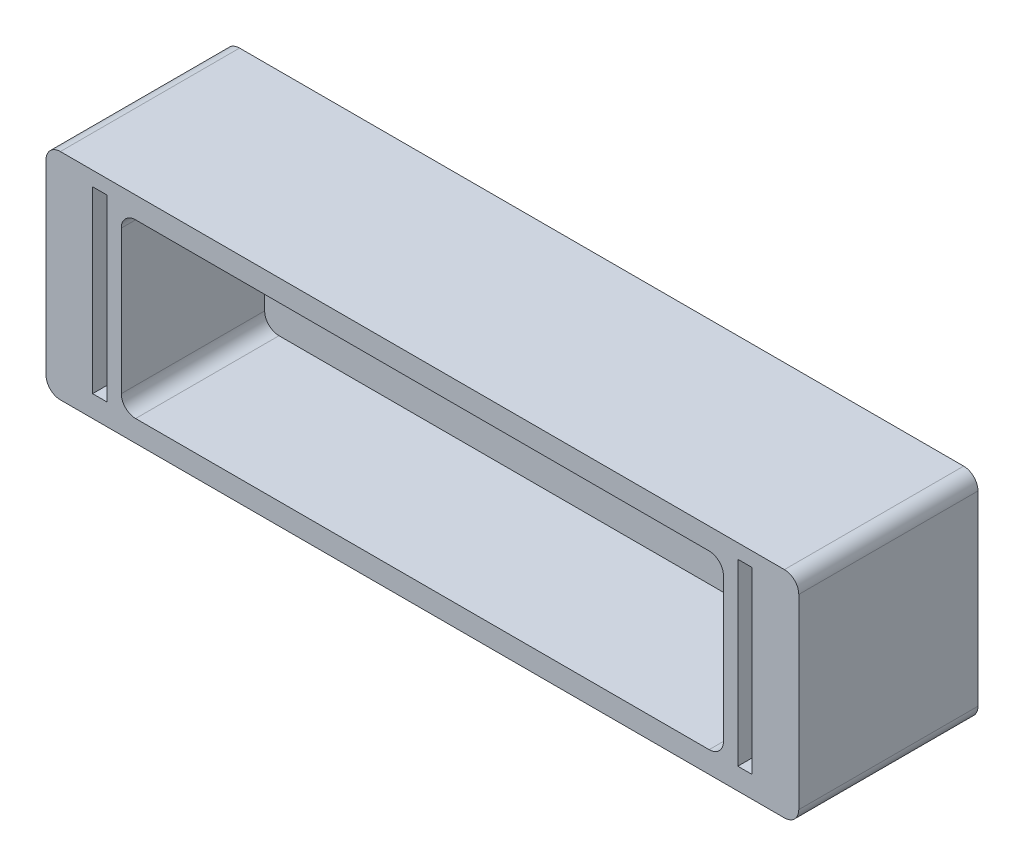
ISO-10303-21;
HEADER;
FILE_DESCRIPTION(('STEP AP214'),'2;1');
FILE_NAME('part.step','',(''),(''),'','','');
FILE_SCHEMA(('AUTOMOTIVE_DESIGN { 1 0 10303 214 1 1 1 1 }'));
ENDSEC;
DATA;
#1=APPLICATION_CONTEXT('core data for automotive mechanical design processes');
#2=APPLICATION_PROTOCOL_DEFINITION('international standard','automotive_design',2000,#1);
#3=PRODUCT_CONTEXT('',#1,'mechanical');
#4=PRODUCT('Part','Part','',(#3));
#5=PRODUCT_RELATED_PRODUCT_CATEGORY('part','',(#4));
#6=PRODUCT_DEFINITION_FORMATION('','',#4);
#7=PRODUCT_DEFINITION_CONTEXT('part definition',#1,'design');
#8=PRODUCT_DEFINITION('design','',#6,#7);
#9=PRODUCT_DEFINITION_SHAPE('','',#8);
#10=(LENGTH_UNIT() NAMED_UNIT(*) SI_UNIT(.MILLI.,.METRE.));
#11=(NAMED_UNIT(*) PLANE_ANGLE_UNIT() SI_UNIT($,.RADIAN.));
#12=(NAMED_UNIT(*) SI_UNIT($,.STERADIAN.) SOLID_ANGLE_UNIT());
#13=UNCERTAINTY_MEASURE_WITH_UNIT(LENGTH_MEASURE(1.E-05),#10,'distance_accuracy_value','');
#14=(GEOMETRIC_REPRESENTATION_CONTEXT(3) GLOBAL_UNCERTAINTY_ASSIGNED_CONTEXT((#13)) GLOBAL_UNIT_ASSIGNED_CONTEXT((#10,
#11,#12)) REPRESENTATION_CONTEXT('',''));
#15=CARTESIAN_POINT('',(0.,0.,0.));
#16=DIRECTION('',(0.,0.,1.));
#17=DIRECTION('',(1.,0.,0.));
#18=AXIS2_PLACEMENT_3D('',#15,#16,#17);
#19=CARTESIAN_POINT('',(-41.8459657701712,49.5476772616137,25.));
#20=DIRECTION('',(1.,0.,0.));
#21=DIRECTION('',(0.,1.,0.));
#22=AXIS2_PLACEMENT_3D('',#19,#20,#21);
#23=PLANE('',#22);
#24=DIRECTION('',(0.,-1.,0.));
#25=VECTOR('',#24,1.);
#26=CARTESIAN_POINT('',(-41.8459657701712,49.5476772616137,0.));
#27=LINE('',#26,#25);
#28=CARTESIAN_POINT('',(-41.8459657701712,47.5476772616137,0.));
#29=VERTEX_POINT('',#28);
#30=CARTESIAN_POINT('',(-41.8459657701711,21.5476772616137,0.));
#31=VERTEX_POINT('',#30);
#32=EDGE_CURVE('E266',#29,#31,#27,.T.);
#33=ORIENTED_EDGE('',*,*,#32,.T.);
#34=DIRECTION('',(0.,0.,-1.));
#35=VECTOR('',#34,1.);
#36=CARTESIAN_POINT('',(-41.8459657701711,21.5476772616137,25.));
#37=LINE('',#36,#35);
#38=CARTESIAN_POINT('',(-41.8459657701711,21.5476772616137,25.));
#39=VERTEX_POINT('',#38);
#40=EDGE_CURVE('E50',#31,#39,#37,.F.);
#41=ORIENTED_EDGE('',*,*,#40,.T.);
#42=DIRECTION('',(0.,-1.,0.));
#43=VECTOR('',#42,1.);
#44=CARTESIAN_POINT('',(-41.8459657701712,49.5476772616137,25.));
#45=LINE('',#44,#43);
#46=CARTESIAN_POINT('',(-41.8459657701712,47.5476772616137,25.));
#47=VERTEX_POINT('',#46);
#48=EDGE_CURVE('E309',#47,#39,#45,.T.);
#49=ORIENTED_EDGE('',*,*,#48,.F.);
#50=DIRECTION('',(0.,0.,-1.));
#51=VECTOR('',#50,1.);
#52=CARTESIAN_POINT('',(-41.8459657701712,47.5476772616137,25.));
#53=LINE('',#52,#51);
#54=EDGE_CURVE('E445',#47,#29,#53,.T.);
#55=ORIENTED_EDGE('',*,*,#54,.T.);
#56=EDGE_LOOP('',(#33,#41,#49,#55));
#57=FACE_BOUND('',#56,.T.);
#58=ADVANCED_FACE('F41',(#57),#23,.F.);
#59=CARTESIAN_POINT('',(-41.8459657701711,19.5476772616137,25.));
#60=DIRECTION('',(0.,1.,0.));
#61=DIRECTION('',(0.,0.,1.));
#62=AXIS2_PLACEMENT_3D('',#59,#60,#61);
#63=PLANE('',#62);
#64=DIRECTION('',(1.,0.,0.));
#65=VECTOR('',#64,1.);
#66=CARTESIAN_POINT('',(-41.8459657701711,19.5476772616137,25.));
#67=LINE('',#66,#65);
#68=CARTESIAN_POINT('',(-39.8459657701711,19.5476772616137,25.));
#69=VERTEX_POINT('',#68);
#70=CARTESIAN_POINT('',(61.1540342298288,19.5476772616137,25.));
#71=VERTEX_POINT('',#70);
#72=EDGE_CURVE('E312',#69,#71,#67,.T.);
#73=ORIENTED_EDGE('',*,*,#72,.F.);
#74=DIRECTION('',(0.,0.,-1.));
#75=VECTOR('',#74,1.);
#76=CARTESIAN_POINT('',(-39.8459657701711,19.5476772616137,25.));
#77=LINE('',#76,#75);
#78=CARTESIAN_POINT('',(-39.8459657701711,19.5476772616137,0.));
#79=VERTEX_POINT('',#78);
#80=EDGE_CURVE('E482',#69,#79,#77,.T.);
#81=ORIENTED_EDGE('',*,*,#80,.T.);
#82=DIRECTION('',(1.,0.,0.));
#83=VECTOR('',#82,1.);
#84=CARTESIAN_POINT('',(-41.8459657701711,19.5476772616137,0.));
#85=LINE('',#84,#83);
#86=CARTESIAN_POINT('',(61.1540342298288,19.5476772616137,0.));
#87=VERTEX_POINT('',#86);
#88=EDGE_CURVE('E327',#79,#87,#85,.T.);
#89=ORIENTED_EDGE('',*,*,#88,.T.);
#90=DIRECTION('',(0.,0.,-1.));
#91=VECTOR('',#90,1.);
#92=CARTESIAN_POINT('',(61.1540342298288,19.5476772616137,25.));
#93=LINE('',#92,#91);
#94=EDGE_CURVE('E425',#87,#71,#93,.F.);
#95=ORIENTED_EDGE('',*,*,#94,.T.);
#96=EDGE_LOOP('',(#73,#81,#89,#95));
#97=FACE_BOUND('',#96,.T.);
#98=ADVANCED_FACE('F529',(#97),#63,.F.);
#99=CARTESIAN_POINT('',(63.1540342298288,49.5476772616137,25.));
#100=DIRECTION('',(-1.,0.,0.));
#101=DIRECTION('',(0.,-1.,0.));
#102=AXIS2_PLACEMENT_3D('',#99,#100,#101);
#103=PLANE('',#102);
#104=DIRECTION('',(0.,1.,0.));
#105=VECTOR('',#104,1.);
#106=CARTESIAN_POINT('',(63.1540342298288,49.5476772616137,25.));
#107=LINE('',#106,#105);
#108=CARTESIAN_POINT('',(63.1540342298288,21.5476772616137,25.));
#109=VERTEX_POINT('',#108);
#110=CARTESIAN_POINT('',(63.1540342298288,47.5476772616137,25.));
#111=VERTEX_POINT('',#110);
#112=EDGE_CURVE('E316',#109,#111,#107,.T.);
#113=ORIENTED_EDGE('',*,*,#112,.F.);
#114=DIRECTION('',(0.,0.,-1.));
#115=VECTOR('',#114,1.);
#116=CARTESIAN_POINT('',(63.1540342298288,21.5476772616137,25.));
#117=LINE('',#116,#115);
#118=CARTESIAN_POINT('',(63.1540342298288,21.5476772616137,0.));
#119=VERTEX_POINT('',#118);
#120=EDGE_CURVE('E411',#109,#119,#117,.T.);
#121=ORIENTED_EDGE('',*,*,#120,.T.);
#122=DIRECTION('',(0.,1.,0.));
#123=VECTOR('',#122,1.);
#124=CARTESIAN_POINT('',(63.1540342298288,49.5476772616137,0.));
#125=LINE('',#124,#123);
#126=CARTESIAN_POINT('',(63.1540342298288,47.5476772616137,0.));
#127=VERTEX_POINT('',#126);
#128=EDGE_CURVE('E330',#119,#127,#125,.T.);
#129=ORIENTED_EDGE('',*,*,#128,.T.);
#130=DIRECTION('',(0.,0.,-1.));
#131=VECTOR('',#130,1.);
#132=CARTESIAN_POINT('',(63.1540342298288,47.5476772616137,25.));
#133=LINE('',#132,#131);
#134=EDGE_CURVE('E408',#127,#111,#133,.F.);
#135=ORIENTED_EDGE('',*,*,#134,.T.);
#136=EDGE_LOOP('',(#113,#121,#129,#135));
#137=FACE_BOUND('',#136,.T.);
#138=ADVANCED_FACE('F534',(#137),#103,.F.);
#139=CARTESIAN_POINT('',(-41.8459657701712,49.5476772616137,25.));
#140=DIRECTION('',(0.,-1.,0.));
#141=DIRECTION('',(0.,0.,-1.));
#142=AXIS2_PLACEMENT_3D('',#139,#140,#141);
#143=PLANE('',#142);
#144=DIRECTION('',(-1.,0.,0.));
#145=VECTOR('',#144,1.);
#146=CARTESIAN_POINT('',(-41.8459657701712,49.5476772616137,25.));
#147=LINE('',#146,#145);
#148=CARTESIAN_POINT('',(61.1540342298288,49.5476772616137,25.));
#149=VERTEX_POINT('',#148);
#150=CARTESIAN_POINT('',(-39.8459657701712,49.5476772616137,25.));
#151=VERTEX_POINT('',#150);
#152=EDGE_CURVE('E320',#149,#151,#147,.T.);
#153=ORIENTED_EDGE('',*,*,#152,.F.);
#154=DIRECTION('',(0.,0.,-1.));
#155=VECTOR('',#154,1.);
#156=CARTESIAN_POINT('',(61.1540342298288,49.5476772616137,25.));
#157=LINE('',#156,#155);
#158=CARTESIAN_POINT('',(61.1540342298288,49.5476772616137,0.));
#159=VERTEX_POINT('',#158);
#160=EDGE_CURVE('E441',#149,#159,#157,.T.);
#161=ORIENTED_EDGE('',*,*,#160,.T.);
#162=DIRECTION('',(-1.,0.,0.));
#163=VECTOR('',#162,1.);
#164=CARTESIAN_POINT('',(-41.8459657701712,49.5476772616137,0.));
#165=LINE('',#164,#163);
#166=CARTESIAN_POINT('',(-39.8459657701712,49.5476772616137,0.));
#167=VERTEX_POINT('',#166);
#168=EDGE_CURVE('E313',#159,#167,#165,.T.);
#169=ORIENTED_EDGE('',*,*,#168,.T.);
#170=DIRECTION('',(0.,0.,-1.));
#171=VECTOR('',#170,1.);
#172=CARTESIAN_POINT('',(-39.8459657701712,49.5476772616137,25.));
#173=LINE('',#172,#171);
#174=EDGE_CURVE('E438',#167,#151,#173,.F.);
#175=ORIENTED_EDGE('',*,*,#174,.T.);
#176=EDGE_LOOP('',(#153,#161,#169,#175));
#177=FACE_BOUND('',#176,.T.);
#178=ADVANCED_FACE('F590',(#177),#143,.F.);
#179=CARTESIAN_POINT('',(0.,0.,25.));
#180=DIRECTION('',(0.,0.,1.));
#181=DIRECTION('',(1.,0.,0.));
#182=AXIS2_PLACEMENT_3D('',#179,#180,#181);
#183=PLANE('',#182);
#184=DIRECTION('',(0.,-1.,0.));
#185=VECTOR('',#184,1.);
#186=CARTESIAN_POINT('',(-31.3459657701711,46.5476772616137,25.));
#187=LINE('',#186,#185);
#188=CARTESIAN_POINT('',(-31.3459657701711,44.5476772616137,25.));
#189=VERTEX_POINT('',#188);
#190=CARTESIAN_POINT('',(-31.3459657701711,24.5476772616137,25.));
#191=VERTEX_POINT('',#190);
#192=EDGE_CURVE('E676',#189,#191,#187,.T.);
#193=ORIENTED_EDGE('',*,*,#192,.F.);
#194=CARTESIAN_POINT('',(-29.3459657701711,44.5476772616137,25.));
#195=DIRECTION('',(0.,0.,1.));
#196=DIRECTION('',(1.,0.,0.));
#197=AXIS2_PLACEMENT_3D('',#194,#195,#196);
#198=CIRCLE('',#197,2.);
#199=CARTESIAN_POINT('',(-29.3459657701711,46.5476772616137,25.));
#200=VERTEX_POINT('',#199);
#201=EDGE_CURVE('E476',#189,#200,#198,.F.);
#202=ORIENTED_EDGE('',*,*,#201,.T.);
#203=DIRECTION('',(-1.,0.,0.));
#204=VECTOR('',#203,1.);
#205=CARTESIAN_POINT('',(-31.3459657701711,46.5476772616137,25.));
#206=LINE('',#205,#204);
#207=CARTESIAN_POINT('',(50.6540342298288,46.5476772616137,25.));
#208=VERTEX_POINT('',#207);
#209=EDGE_CURVE('E498',#208,#200,#206,.T.);
#210=ORIENTED_EDGE('',*,*,#209,.F.);
#211=CARTESIAN_POINT('',(50.6540342298288,44.5476772616137,25.));
#212=DIRECTION('',(0.,0.,1.));
#213=DIRECTION('',(1.,0.,0.));
#214=AXIS2_PLACEMENT_3D('',#211,#212,#213);
#215=CIRCLE('',#214,2.);
#216=CARTESIAN_POINT('',(52.6540342298288,44.5476772616137,25.));
#217=VERTEX_POINT('',#216);
#218=EDGE_CURVE('E449',#208,#217,#215,.F.);
#219=ORIENTED_EDGE('',*,*,#218,.T.);
#220=DIRECTION('',(0.,1.,0.));
#221=VECTOR('',#220,1.);
#222=CARTESIAN_POINT('',(52.6540342298288,46.5476772616137,25.));
#223=LINE('',#222,#221);
#224=CARTESIAN_POINT('',(52.6540342298288,24.5476772616137,25.));
#225=VERTEX_POINT('',#224);
#226=EDGE_CURVE('E682',#225,#217,#223,.T.);
#227=ORIENTED_EDGE('',*,*,#226,.F.);
#228=CARTESIAN_POINT('',(50.6540342298288,24.5476772616137,25.));
#229=DIRECTION('',(0.,0.,1.));
#230=DIRECTION('',(1.,0.,0.));
#231=AXIS2_PLACEMENT_3D('',#228,#229,#230);
#232=CIRCLE('',#231,2.);
#233=CARTESIAN_POINT('',(50.6540342298288,22.5476772616137,25.));
#234=VERTEX_POINT('',#233);
#235=EDGE_CURVE('E452',#225,#234,#232,.F.);
#236=ORIENTED_EDGE('',*,*,#235,.T.);
#237=DIRECTION('',(1.,0.,0.));
#238=VECTOR('',#237,1.);
#239=CARTESIAN_POINT('',(-31.3459657701711,22.5476772616137,25.));
#240=LINE('',#239,#238);
#241=CARTESIAN_POINT('',(-29.3459657701711,22.5476772616137,25.));
#242=VERTEX_POINT('',#241);
#243=EDGE_CURVE('E680',#242,#234,#240,.T.);
#244=ORIENTED_EDGE('',*,*,#243,.F.);
#245=CARTESIAN_POINT('',(-29.3459657701711,24.5476772616137,25.));
#246=DIRECTION('',(0.,0.,1.));
#247=DIRECTION('',(1.,0.,0.));
#248=AXIS2_PLACEMENT_3D('',#245,#246,#247);
#249=CIRCLE('',#248,2.);
#250=EDGE_CURVE('E479',#242,#191,#249,.F.);
#251=ORIENTED_EDGE('',*,*,#250,.T.);
#252=EDGE_LOOP('',(#193,#202,#210,#219,#227,#236,#244,#251));
#253=FACE_BOUND('',#252,.T.);
#254=DIRECTION('',(0.,-1.,0.));
#255=VECTOR('',#254,1.);
#256=CARTESIAN_POINT('',(-35.3459657701711,47.5476772616137,25.));
#257=LINE('',#256,#255);
#258=CARTESIAN_POINT('',(-35.3459657701711,47.5476772616137,25.));
#259=VERTEX_POINT('',#258);
#260=CARTESIAN_POINT('',(-35.3459657701711,22.5476772616137,25.));
#261=VERTEX_POINT('',#260);
#262=EDGE_CURVE('E250',#259,#261,#257,.T.);
#263=ORIENTED_EDGE('',*,*,#262,.F.);
#264=DIRECTION('',(-1.,0.,0.));
#265=VECTOR('',#264,1.);
#266=CARTESIAN_POINT('',(-35.3459657701711,47.5476772616137,25.));
#267=LINE('',#266,#265);
#268=CARTESIAN_POINT('',(-33.3459657701711,47.5476772616137,25.));
#269=VERTEX_POINT('',#268);
#270=EDGE_CURVE('E255',#269,#259,#267,.T.);
#271=ORIENTED_EDGE('',*,*,#270,.F.);
#272=DIRECTION('',(0.,1.,0.));
#273=VECTOR('',#272,1.);
#274=CARTESIAN_POINT('',(-33.3459657701711,47.5476772616137,25.));
#275=LINE('',#274,#273);
#276=CARTESIAN_POINT('',(-33.3459657701711,22.5476772616137,25.));
#277=VERTEX_POINT('',#276);
#278=EDGE_CURVE('E232',#277,#269,#275,.T.);
#279=ORIENTED_EDGE('',*,*,#278,.F.);
#280=DIRECTION('',(1.,0.,0.));
#281=VECTOR('',#280,1.);
#282=CARTESIAN_POINT('',(-35.3459657701711,22.5476772616137,25.));
#283=LINE('',#282,#281);
#284=EDGE_CURVE('E243',#261,#277,#283,.T.);
#285=ORIENTED_EDGE('',*,*,#284,.F.);
#286=EDGE_LOOP('',(#263,#271,#279,#285));
#287=FACE_BOUND('',#286,.T.);
#288=DIRECTION('',(-1.,0.,0.));
#289=VECTOR('',#288,1.);
#290=CARTESIAN_POINT('',(56.6540342298289,47.5476772616137,25.));
#291=LINE('',#290,#289);
#292=CARTESIAN_POINT('',(56.6540342298289,47.5476772616137,25.));
#293=VERTEX_POINT('',#292);
#294=CARTESIAN_POINT('',(54.6540342298288,47.5476772616137,25.));
#295=VERTEX_POINT('',#294);
#296=EDGE_CURVE('E282',#293,#295,#291,.T.);
#297=ORIENTED_EDGE('',*,*,#296,.F.);
#298=DIRECTION('',(0.,1.,0.));
#299=VECTOR('',#298,1.);
#300=CARTESIAN_POINT('',(56.6540342298289,47.5476772616137,25.));
#301=LINE('',#300,#299);
#302=CARTESIAN_POINT('',(56.6540342298289,22.5476772616137,25.));
#303=VERTEX_POINT('',#302);
#304=EDGE_CURVE('E277',#303,#293,#301,.T.);
#305=ORIENTED_EDGE('',*,*,#304,.F.);
#306=DIRECTION('',(1.,0.,0.));
#307=VECTOR('',#306,1.);
#308=CARTESIAN_POINT('',(56.6540342298289,22.5476772616137,25.));
#309=LINE('',#308,#307);
#310=CARTESIAN_POINT('',(54.6540342298288,22.5476772616137,25.));
#311=VERTEX_POINT('',#310);
#312=EDGE_CURVE('E291',#311,#303,#309,.T.);
#313=ORIENTED_EDGE('',*,*,#312,.F.);
#314=DIRECTION('',(0.,-1.,0.));
#315=VECTOR('',#314,1.);
#316=CARTESIAN_POINT('',(54.6540342298288,47.5476772616137,25.));
#317=LINE('',#316,#315);
#318=EDGE_CURVE('E286',#295,#311,#317,.T.);
#319=ORIENTED_EDGE('',*,*,#318,.F.);
#320=EDGE_LOOP('',(#297,#305,#313,#319));
#321=FACE_BOUND('',#320,.T.);
#322=ORIENTED_EDGE('',*,*,#48,.T.);
#323=CARTESIAN_POINT('',(-39.8459657701711,21.5476772616137,25.));
#324=DIRECTION('',(0.,0.,1.));
#325=DIRECTION('',(1.,0.,0.));
#326=AXIS2_PLACEMENT_3D('',#323,#324,#325);
#327=CIRCLE('',#326,2.);
#328=EDGE_CURVE('E11',#39,#69,#327,.T.);
#329=ORIENTED_EDGE('',*,*,#328,.T.);
#330=ORIENTED_EDGE('',*,*,#72,.T.);
#331=CARTESIAN_POINT('',(61.1540342298288,21.5476772616137,25.));
#332=DIRECTION('',(0.,0.,1.));
#333=DIRECTION('',(1.,0.,0.));
#334=AXIS2_PLACEMENT_3D('',#331,#332,#333);
#335=CIRCLE('',#334,2.);
#336=EDGE_CURVE('E435',#71,#109,#335,.T.);
#337=ORIENTED_EDGE('',*,*,#336,.T.);
#338=ORIENTED_EDGE('',*,*,#112,.T.);
#339=CARTESIAN_POINT('',(61.1540342298288,47.5476772616137,25.));
#340=DIRECTION('',(0.,0.,1.));
#341=DIRECTION('',(1.,0.,0.));
#342=AXIS2_PLACEMENT_3D('',#339,#340,#341);
#343=CIRCLE('',#342,2.);
#344=EDGE_CURVE('E432',#111,#149,#343,.T.);
#345=ORIENTED_EDGE('',*,*,#344,.T.);
#346=ORIENTED_EDGE('',*,*,#152,.T.);
#347=CARTESIAN_POINT('',(-39.8459657701712,47.5476772616137,25.));
#348=DIRECTION('',(0.,0.,1.));
#349=DIRECTION('',(1.,0.,0.));
#350=AXIS2_PLACEMENT_3D('',#347,#348,#349);
#351=CIRCLE('',#350,2.);
#352=EDGE_CURVE('E429',#151,#47,#351,.T.);
#353=ORIENTED_EDGE('',*,*,#352,.T.);
#354=EDGE_LOOP('',(#322,#329,#330,#337,#338,#345,#346,#353));
#355=FACE_BOUND('',#354,.T.);
#356=ADVANCED_FACE('F252',(#253,#287,#321,#355),#183,.T.);
#357=CARTESIAN_POINT('',(0.,0.,0.));
#358=DIRECTION('',(0.,0.,1.));
#359=DIRECTION('',(1.,0.,0.));
#360=AXIS2_PLACEMENT_3D('',#357,#358,#359);
#361=PLANE('',#360);
#362=ORIENTED_EDGE('',*,*,#88,.F.);
#363=CARTESIAN_POINT('',(-39.8459657701711,21.5476772616137,0.));
#364=DIRECTION('',(0.,0.,1.));
#365=DIRECTION('',(1.,0.,0.));
#366=AXIS2_PLACEMENT_3D('',#363,#364,#365);
#367=CIRCLE('',#366,2.);
#368=EDGE_CURVE('E64',#79,#31,#367,.F.);
#369=ORIENTED_EDGE('',*,*,#368,.T.);
#370=ORIENTED_EDGE('',*,*,#32,.F.);
#371=CARTESIAN_POINT('',(-39.8459657701712,47.5476772616137,0.));
#372=DIRECTION('',(0.,0.,1.));
#373=DIRECTION('',(1.,0.,0.));
#374=AXIS2_PLACEMENT_3D('',#371,#372,#373);
#375=CIRCLE('',#374,2.);
#376=EDGE_CURVE('E415',#29,#167,#375,.F.);
#377=ORIENTED_EDGE('',*,*,#376,.T.);
#378=ORIENTED_EDGE('',*,*,#168,.F.);
#379=CARTESIAN_POINT('',(61.1540342298288,47.5476772616137,0.));
#380=DIRECTION('',(0.,0.,1.));
#381=DIRECTION('',(1.,0.,0.));
#382=AXIS2_PLACEMENT_3D('',#379,#380,#381);
#383=CIRCLE('',#382,2.);
#384=EDGE_CURVE('E418',#159,#127,#383,.F.);
#385=ORIENTED_EDGE('',*,*,#384,.T.);
#386=ORIENTED_EDGE('',*,*,#128,.F.);
#387=CARTESIAN_POINT('',(61.1540342298288,21.5476772616137,0.));
#388=DIRECTION('',(0.,0.,1.));
#389=DIRECTION('',(1.,0.,0.));
#390=AXIS2_PLACEMENT_3D('',#387,#388,#389);
#391=CIRCLE('',#390,2.);
#392=EDGE_CURVE('E421',#119,#87,#391,.F.);
#393=ORIENTED_EDGE('',*,*,#392,.T.);
#394=EDGE_LOOP('',(#362,#369,#370,#377,#378,#385,#386,#393));
#395=FACE_BOUND('',#394,.T.);
#396=ADVANCED_FACE('F581',(#395),#361,.F.);
#397=CARTESIAN_POINT('',(56.6540342298289,47.5476772616137,1.));
#398=DIRECTION('',(0.,1.,0.));
#399=DIRECTION('',(0.,0.,1.));
#400=AXIS2_PLACEMENT_3D('',#397,#398,#399);
#401=PLANE('',#400);
#402=DIRECTION('',(0.,0.,1.));
#403=VECTOR('',#402,1.);
#404=CARTESIAN_POINT('',(54.6540342298288,47.5476772616137,1.));
#405=LINE('',#404,#403);
#406=CARTESIAN_POINT('',(54.6540342298288,47.5476772616137,13.));
#407=VERTEX_POINT('',#406);
#408=EDGE_CURVE('E281',#407,#295,#405,.T.);
#409=ORIENTED_EDGE('',*,*,#408,.F.);
#410=DIRECTION('',(-1.,0.,0.));
#411=VECTOR('',#410,1.);
#412=CARTESIAN_POINT('',(56.6540342298289,47.5476772616137,13.));
#413=LINE('',#412,#411);
#414=CARTESIAN_POINT('',(56.6540342298289,47.5476772616137,13.));
#415=VERTEX_POINT('',#414);
#416=EDGE_CURVE('E350',#407,#415,#413,.F.);
#417=ORIENTED_EDGE('',*,*,#416,.T.);
#418=DIRECTION('',(0.,0.,1.));
#419=VECTOR('',#418,1.);
#420=CARTESIAN_POINT('',(56.6540342298289,47.5476772616137,1.));
#421=LINE('',#420,#419);
#422=EDGE_CURVE('E298',#415,#293,#421,.T.);
#423=ORIENTED_EDGE('',*,*,#422,.T.);
#424=ORIENTED_EDGE('',*,*,#296,.T.);
#425=EDGE_LOOP('',(#409,#417,#423,#424));
#426=FACE_BOUND('',#425,.T.);
#427=ADVANCED_FACE('F562',(#426),#401,.F.);
#428=CARTESIAN_POINT('',(56.6540342298289,47.5476772616137,1.));
#429=DIRECTION('',(1.,0.,0.));
#430=DIRECTION('',(0.,0.,-1.));
#431=AXIS2_PLACEMENT_3D('',#428,#429,#430);
#432=PLANE('',#431);
#433=ORIENTED_EDGE('',*,*,#422,.F.);
#434=CARTESIAN_POINT('',(56.6540342298289,35.5476772616137,13.));
#435=DIRECTION('',(1.,0.,0.));
#436=DIRECTION('',(0.,0.,-1.));
#437=AXIS2_PLACEMENT_3D('',#434,#435,#436);
#438=CIRCLE('',#437,12.);
#439=CARTESIAN_POINT('',(56.6540342298289,35.5476772616137,1.));
#440=VERTEX_POINT('',#439);
#441=EDGE_CURVE('E356',#415,#440,#438,.F.);
#442=ORIENTED_EDGE('',*,*,#441,.T.);
#443=DIRECTION('',(0.,1.,0.));
#444=VECTOR('',#443,1.);
#445=CARTESIAN_POINT('',(56.6540342298289,47.5476772616137,1.));
#446=LINE('',#445,#444);
#447=CARTESIAN_POINT('',(56.6540342298289,34.5476772616137,1.));
#448=VERTEX_POINT('',#447);
#449=EDGE_CURVE('E276',#448,#440,#446,.T.);
#450=ORIENTED_EDGE('',*,*,#449,.F.);
#451=CARTESIAN_POINT('',(56.6540342298289,34.5476772616137,13.));
#452=DIRECTION('',(1.,0.,0.));
#453=DIRECTION('',(0.,0.,-1.));
#454=AXIS2_PLACEMENT_3D('',#451,#452,#453);
#455=CIRCLE('',#454,12.);
#456=CARTESIAN_POINT('',(56.6540342298289,22.5476772616137,13.));
#457=VERTEX_POINT('',#456);
#458=EDGE_CURVE('E353',#448,#457,#455,.F.);
#459=ORIENTED_EDGE('',*,*,#458,.T.);
#460=DIRECTION('',(0.,0.,1.));
#461=VECTOR('',#460,1.);
#462=CARTESIAN_POINT('',(56.6540342298289,22.5476772616137,1.));
#463=LINE('',#462,#461);
#464=EDGE_CURVE('E301',#457,#303,#463,.T.);
#465=ORIENTED_EDGE('',*,*,#464,.T.);
#466=ORIENTED_EDGE('',*,*,#304,.T.);
#467=EDGE_LOOP('',(#433,#442,#450,#459,#465,#466));
#468=FACE_BOUND('',#467,.T.);
#469=ADVANCED_FACE('F573',(#468),#432,.F.);
#470=CARTESIAN_POINT('',(56.6540342298289,22.5476772616137,1.));
#471=DIRECTION('',(0.,-1.,0.));
#472=DIRECTION('',(0.,0.,-1.));
#473=AXIS2_PLACEMENT_3D('',#470,#471,#472);
#474=PLANE('',#473);
#475=ORIENTED_EDGE('',*,*,#464,.F.);
#476=DIRECTION('',(1.,0.,0.));
#477=VECTOR('',#476,1.);
#478=CARTESIAN_POINT('',(56.6540342298289,22.5476772616137,13.));
#479=LINE('',#478,#477);
#480=CARTESIAN_POINT('',(54.6540342298288,22.5476772616137,13.));
#481=VERTEX_POINT('',#480);
#482=EDGE_CURVE('E359',#457,#481,#479,.F.);
#483=ORIENTED_EDGE('',*,*,#482,.T.);
#484=DIRECTION('',(0.,0.,1.));
#485=VECTOR('',#484,1.);
#486=CARTESIAN_POINT('',(54.6540342298288,22.5476772616137,1.));
#487=LINE('',#486,#485);
#488=EDGE_CURVE('E304',#481,#311,#487,.T.);
#489=ORIENTED_EDGE('',*,*,#488,.T.);
#490=ORIENTED_EDGE('',*,*,#312,.T.);
#491=EDGE_LOOP('',(#475,#483,#489,#490));
#492=FACE_BOUND('',#491,.T.);
#493=ADVANCED_FACE('F571',(#492),#474,.F.);
#494=CARTESIAN_POINT('',(54.6540342298288,47.5476772616137,1.));
#495=DIRECTION('',(-1.,0.,0.));
#496=DIRECTION('',(0.,0.,1.));
#497=AXIS2_PLACEMENT_3D('',#494,#495,#496);
#498=PLANE('',#497);
#499=DIRECTION('',(0.,-1.,0.));
#500=VECTOR('',#499,1.);
#501=CARTESIAN_POINT('',(54.6540342298288,47.5476772616137,1.));
#502=LINE('',#501,#500);
#503=CARTESIAN_POINT('',(54.6540342298288,35.5476772616137,1.));
#504=VERTEX_POINT('',#503);
#505=CARTESIAN_POINT('',(54.6540342298288,34.5476772616137,1.));
#506=VERTEX_POINT('',#505);
#507=EDGE_CURVE('E272',#504,#506,#502,.T.);
#508=ORIENTED_EDGE('',*,*,#507,.F.);
#509=CARTESIAN_POINT('',(54.6540342298288,35.5476772616137,13.));
#510=DIRECTION('',(-1.,0.,0.));
#511=DIRECTION('',(0.,0.,1.));
#512=AXIS2_PLACEMENT_3D('',#509,#510,#511);
#513=CIRCLE('',#512,12.);
#514=EDGE_CURVE('E347',#504,#407,#513,.F.);
#515=ORIENTED_EDGE('',*,*,#514,.T.);
#516=ORIENTED_EDGE('',*,*,#408,.T.);
#517=ORIENTED_EDGE('',*,*,#318,.T.);
#518=ORIENTED_EDGE('',*,*,#488,.F.);
#519=CARTESIAN_POINT('',(54.6540342298288,34.5476772616137,13.));
#520=DIRECTION('',(-1.,0.,0.));
#521=DIRECTION('',(0.,0.,1.));
#522=AXIS2_PLACEMENT_3D('',#519,#520,#521);
#523=CIRCLE('',#522,12.);
#524=EDGE_CURVE('E344',#481,#506,#523,.F.);
#525=ORIENTED_EDGE('',*,*,#524,.T.);
#526=EDGE_LOOP('',(#508,#515,#516,#517,#518,#525));
#527=FACE_BOUND('',#526,.T.);
#528=ADVANCED_FACE('F553',(#527),#498,.F.);
#529=CARTESIAN_POINT('',(0.,0.,1.));
#530=DIRECTION('',(0.,0.,1.));
#531=DIRECTION('',(1.,0.,0.));
#532=AXIS2_PLACEMENT_3D('',#529,#530,#531);
#533=PLANE('',#532);
#534=ORIENTED_EDGE('',*,*,#449,.T.);
#535=DIRECTION('',(-1.,0.,0.));
#536=VECTOR('',#535,1.);
#537=CARTESIAN_POINT('',(0.,35.5476772616137,1.));
#538=LINE('',#537,#536);
#539=EDGE_CURVE('E340',#440,#504,#538,.T.);
#540=ORIENTED_EDGE('',*,*,#539,.T.);
#541=ORIENTED_EDGE('',*,*,#507,.T.);
#542=DIRECTION('',(1.,0.,0.));
#543=VECTOR('',#542,1.);
#544=CARTESIAN_POINT('',(0.,34.5476772616137,1.));
#545=LINE('',#544,#543);
#546=EDGE_CURVE('E324',#506,#448,#545,.T.);
#547=ORIENTED_EDGE('',*,*,#546,.T.);
#548=EDGE_LOOP('',(#534,#540,#541,#547));
#549=FACE_BOUND('',#548,.T.);
#550=ADVANCED_FACE('F555',(#549),#533,.T.);
#551=CARTESIAN_POINT('',(-35.3459657701711,47.5476772616137,1.));
#552=DIRECTION('',(-1.,0.,0.));
#553=DIRECTION('',(0.,0.,1.));
#554=AXIS2_PLACEMENT_3D('',#551,#552,#553);
#555=PLANE('',#554);
#556=DIRECTION('',(0.,-1.,0.));
#557=VECTOR('',#556,1.);
#558=CARTESIAN_POINT('',(-35.3459657701711,47.5476772616137,1.));
#559=LINE('',#558,#557);
#560=CARTESIAN_POINT('',(-35.3459657701711,35.5476772616137,1.));
#561=VERTEX_POINT('',#560);
#562=CARTESIAN_POINT('',(-35.3459657701711,34.5476772616137,1.));
#563=VERTEX_POINT('',#562);
#564=EDGE_CURVE('E259',#561,#563,#559,.T.);
#565=ORIENTED_EDGE('',*,*,#564,.F.);
#566=CARTESIAN_POINT('',(-35.3459657701711,35.5476772616137,13.));
#567=DIRECTION('',(-1.,0.,0.));
#568=DIRECTION('',(0.,0.,1.));
#569=AXIS2_PLACEMENT_3D('',#566,#567,#568);
#570=CIRCLE('',#569,12.);
#571=CARTESIAN_POINT('',(-35.3459657701711,47.5476772616137,13.));
#572=VERTEX_POINT('',#571);
#573=EDGE_CURVE('E373',#561,#572,#570,.F.);
#574=ORIENTED_EDGE('',*,*,#573,.T.);
#575=DIRECTION('',(0.,0.,1.));
#576=VECTOR('',#575,1.);
#577=CARTESIAN_POINT('',(-35.3459657701711,47.5476772616137,1.));
#578=LINE('',#577,#576);
#579=EDGE_CURVE('E263',#572,#259,#578,.T.);
#580=ORIENTED_EDGE('',*,*,#579,.T.);
#581=ORIENTED_EDGE('',*,*,#262,.T.);
#582=DIRECTION('',(0.,0.,1.));
#583=VECTOR('',#582,1.);
#584=CARTESIAN_POINT('',(-35.3459657701711,22.5476772616137,1.));
#585=LINE('',#584,#583);
#586=CARTESIAN_POINT('',(-35.3459657701711,22.5476772616137,13.));
#587=VERTEX_POINT('',#586);
#588=EDGE_CURVE('E240',#587,#261,#585,.T.);
#589=ORIENTED_EDGE('',*,*,#588,.F.);
#590=CARTESIAN_POINT('',(-35.3459657701711,34.5476772616137,13.));
#591=DIRECTION('',(-1.,0.,0.));
#592=DIRECTION('',(0.,0.,1.));
#593=AXIS2_PLACEMENT_3D('',#590,#591,#592);
#594=CIRCLE('',#593,12.);
#595=EDGE_CURVE('E370',#587,#563,#594,.F.);
#596=ORIENTED_EDGE('',*,*,#595,.T.);
#597=EDGE_LOOP('',(#565,#574,#580,#581,#589,#596));
#598=FACE_BOUND('',#597,.T.);
#599=ADVANCED_FACE('F502',(#598),#555,.F.);
#600=CARTESIAN_POINT('',(-35.3459657701711,47.5476772616137,1.));
#601=DIRECTION('',(0.,1.,0.));
#602=DIRECTION('',(0.,0.,1.));
#603=AXIS2_PLACEMENT_3D('',#600,#601,#602);
#604=PLANE('',#603);
#605=ORIENTED_EDGE('',*,*,#579,.F.);
#606=DIRECTION('',(-1.,0.,0.));
#607=VECTOR('',#606,1.);
#608=CARTESIAN_POINT('',(-35.3459657701711,47.5476772616137,13.));
#609=LINE('',#608,#607);
#610=CARTESIAN_POINT('',(-33.3459657701711,47.5476772616137,13.));
#611=VERTEX_POINT('',#610);
#612=EDGE_CURVE('E376',#572,#611,#609,.F.);
#613=ORIENTED_EDGE('',*,*,#612,.T.);
#614=DIRECTION('',(0.,0.,1.));
#615=VECTOR('',#614,1.);
#616=CARTESIAN_POINT('',(-33.3459657701711,47.5476772616137,1.));
#617=LINE('',#616,#615);
#618=EDGE_CURVE('E239',#611,#269,#617,.T.);
#619=ORIENTED_EDGE('',*,*,#618,.T.);
#620=ORIENTED_EDGE('',*,*,#270,.T.);
#621=EDGE_LOOP('',(#605,#613,#619,#620));
#622=FACE_BOUND('',#621,.T.);
#623=ADVANCED_FACE('F507',(#622),#604,.F.);
#624=CARTESIAN_POINT('',(-33.3459657701711,47.5476772616137,1.));
#625=DIRECTION('',(1.,0.,0.));
#626=DIRECTION('',(0.,0.,-1.));
#627=AXIS2_PLACEMENT_3D('',#624,#625,#626);
#628=PLANE('',#627);
#629=ORIENTED_EDGE('',*,*,#618,.F.);
#630=CARTESIAN_POINT('',(-33.3459657701711,35.5476772616137,13.));
#631=DIRECTION('',(1.,0.,0.));
#632=DIRECTION('',(0.,0.,-1.));
#633=AXIS2_PLACEMENT_3D('',#630,#631,#632);
#634=CIRCLE('',#633,12.);
#635=CARTESIAN_POINT('',(-33.3459657701711,35.5476772616137,1.));
#636=VERTEX_POINT('',#635);
#637=EDGE_CURVE('E381',#611,#636,#634,.F.);
#638=ORIENTED_EDGE('',*,*,#637,.T.);
#639=DIRECTION('',(0.,1.,0.));
#640=VECTOR('',#639,1.);
#641=CARTESIAN_POINT('',(-33.3459657701711,47.5476772616137,1.));
#642=LINE('',#641,#640);
#643=CARTESIAN_POINT('',(-33.3459657701711,34.5476772616137,1.));
#644=VERTEX_POINT('',#643);
#645=EDGE_CURVE('E271',#644,#636,#642,.T.);
#646=ORIENTED_EDGE('',*,*,#645,.F.);
#647=CARTESIAN_POINT('',(-33.3459657701711,34.5476772616137,13.));
#648=DIRECTION('',(1.,0.,0.));
#649=DIRECTION('',(0.,0.,-1.));
#650=AXIS2_PLACEMENT_3D('',#647,#648,#649);
#651=CIRCLE('',#650,12.);
#652=CARTESIAN_POINT('',(-33.3459657701711,22.5476772616137,13.));
#653=VERTEX_POINT('',#652);
#654=EDGE_CURVE('E235',#644,#653,#651,.F.);
#655=ORIENTED_EDGE('',*,*,#654,.T.);
#656=DIRECTION('',(0.,0.,1.));
#657=VECTOR('',#656,1.);
#658=CARTESIAN_POINT('',(-33.3459657701711,22.5476772616137,1.));
#659=LINE('',#658,#657);
#660=EDGE_CURVE('E227',#653,#277,#659,.T.);
#661=ORIENTED_EDGE('',*,*,#660,.T.);
#662=ORIENTED_EDGE('',*,*,#278,.T.);
#663=EDGE_LOOP('',(#629,#638,#646,#655,#661,#662));
#664=FACE_BOUND('',#663,.T.);
#665=ADVANCED_FACE('F230',(#664),#628,.F.);
#666=CARTESIAN_POINT('',(-35.3459657701711,22.5476772616137,1.));
#667=DIRECTION('',(0.,-1.,0.));
#668=DIRECTION('',(0.,0.,-1.));
#669=AXIS2_PLACEMENT_3D('',#666,#667,#668);
#670=PLANE('',#669);
#671=ORIENTED_EDGE('',*,*,#660,.F.);
#672=DIRECTION('',(1.,0.,0.));
#673=VECTOR('',#672,1.);
#674=CARTESIAN_POINT('',(-35.3459657701711,22.5476772616137,13.));
#675=LINE('',#674,#673);
#676=EDGE_CURVE('E384',#653,#587,#675,.F.);
#677=ORIENTED_EDGE('',*,*,#676,.T.);
#678=ORIENTED_EDGE('',*,*,#588,.T.);
#679=ORIENTED_EDGE('',*,*,#284,.T.);
#680=EDGE_LOOP('',(#671,#677,#678,#679));
#681=FACE_BOUND('',#680,.T.);
#682=ADVANCED_FACE('F244',(#681),#670,.F.);
#683=CARTESIAN_POINT('',(0.,0.,1.));
#684=DIRECTION('',(0.,0.,1.));
#685=DIRECTION('',(1.,0.,0.));
#686=AXIS2_PLACEMENT_3D('',#683,#684,#685);
#687=PLANE('',#686);
#688=ORIENTED_EDGE('',*,*,#645,.T.);
#689=DIRECTION('',(-1.,0.,0.));
#690=VECTOR('',#689,1.);
#691=CARTESIAN_POINT('',(0.,35.5476772616137,1.));
#692=LINE('',#691,#690);
#693=EDGE_CURVE('E366',#636,#561,#692,.T.);
#694=ORIENTED_EDGE('',*,*,#693,.T.);
#695=ORIENTED_EDGE('',*,*,#564,.T.);
#696=DIRECTION('',(1.,0.,0.));
#697=VECTOR('',#696,1.);
#698=CARTESIAN_POINT('',(0.,34.5476772616137,1.));
#699=LINE('',#698,#697);
#700=EDGE_CURVE('E362',#563,#644,#699,.T.);
#701=ORIENTED_EDGE('',*,*,#700,.T.);
#702=EDGE_LOOP('',(#688,#694,#695,#701));
#703=FACE_BOUND('',#702,.T.);
#704=ADVANCED_FACE('F512',(#703),#687,.T.);
#705=CARTESIAN_POINT('',(0.,35.5476772616137,13.));
#706=DIRECTION('',(-1.,0.,0.));
#707=DIRECTION('',(0.,0.,1.));
#708=AXIS2_PLACEMENT_3D('',#705,#706,#707);
#709=CYLINDRICAL_SURFACE('',#708,12.);
#710=ORIENTED_EDGE('',*,*,#441,.F.);
#711=ORIENTED_EDGE('',*,*,#416,.F.);
#712=ORIENTED_EDGE('',*,*,#514,.F.);
#713=ORIENTED_EDGE('',*,*,#539,.F.);
#714=EDGE_LOOP('',(#710,#711,#712,#713));
#715=FACE_BOUND('',#714,.T.);
#716=ADVANCED_FACE('F539',(#715),#709,.F.);
#717=CARTESIAN_POINT('',(0.,34.5476772616137,13.));
#718=DIRECTION('',(1.,0.,0.));
#719=DIRECTION('',(0.,0.,-1.));
#720=AXIS2_PLACEMENT_3D('',#717,#718,#719);
#721=CYLINDRICAL_SURFACE('',#720,12.);
#722=ORIENTED_EDGE('',*,*,#524,.F.);
#723=ORIENTED_EDGE('',*,*,#482,.F.);
#724=ORIENTED_EDGE('',*,*,#458,.F.);
#725=ORIENTED_EDGE('',*,*,#546,.F.);
#726=EDGE_LOOP('',(#722,#723,#724,#725));
#727=FACE_BOUND('',#726,.T.);
#728=ADVANCED_FACE('F525',(#727),#721,.F.);
#729=CARTESIAN_POINT('',(0.,35.5476772616137,13.));
#730=DIRECTION('',(-1.,0.,0.));
#731=DIRECTION('',(0.,0.,1.));
#732=AXIS2_PLACEMENT_3D('',#729,#730,#731);
#733=CYLINDRICAL_SURFACE('',#732,12.);
#734=ORIENTED_EDGE('',*,*,#637,.F.);
#735=ORIENTED_EDGE('',*,*,#612,.F.);
#736=ORIENTED_EDGE('',*,*,#573,.F.);
#737=ORIENTED_EDGE('',*,*,#693,.F.);
#738=EDGE_LOOP('',(#734,#735,#736,#737));
#739=FACE_BOUND('',#738,.T.);
#740=ADVANCED_FACE('F511',(#739),#733,.F.);
#741=CARTESIAN_POINT('',(0.,34.5476772616137,13.));
#742=DIRECTION('',(1.,0.,0.));
#743=DIRECTION('',(0.,0.,-1.));
#744=AXIS2_PLACEMENT_3D('',#741,#742,#743);
#745=CYLINDRICAL_SURFACE('',#744,12.);
#746=ORIENTED_EDGE('',*,*,#595,.F.);
#747=ORIENTED_EDGE('',*,*,#676,.F.);
#748=ORIENTED_EDGE('',*,*,#654,.F.);
#749=ORIENTED_EDGE('',*,*,#700,.F.);
#750=EDGE_LOOP('',(#746,#747,#748,#749));
#751=FACE_BOUND('',#750,.T.);
#752=ADVANCED_FACE('F514',(#751),#745,.F.);
#753=CARTESIAN_POINT('',(-31.3459657701711,46.5476772616137,5.));
#754=DIRECTION('',(-1.,0.,0.));
#755=DIRECTION('',(0.,0.,1.));
#756=AXIS2_PLACEMENT_3D('',#753,#754,#755);
#757=PLANE('',#756);
#758=DIRECTION('',(0.,-1.,0.));
#759=VECTOR('',#758,1.);
#760=CARTESIAN_POINT('',(-31.3459657701711,46.5476772616137,5.));
#761=LINE('',#760,#759);
#762=CARTESIAN_POINT('',(-31.3459657701711,44.5476772616137,5.));
#763=VERTEX_POINT('',#762);
#764=CARTESIAN_POINT('',(-31.3459657701711,24.5476772616137,5.));
#765=VERTEX_POINT('',#764);
#766=EDGE_CURVE('E688',#763,#765,#761,.T.);
#767=ORIENTED_EDGE('',*,*,#766,.F.);
#768=DIRECTION('',(0.,0.,1.));
#769=VECTOR('',#768,1.);
#770=CARTESIAN_POINT('',(-31.3459657701711,44.5476772616137,25.));
#771=LINE('',#770,#769);
#772=EDGE_CURVE('E459',#763,#189,#771,.T.);
#773=ORIENTED_EDGE('',*,*,#772,.T.);
#774=ORIENTED_EDGE('',*,*,#192,.T.);
#775=DIRECTION('',(0.,0.,1.));
#776=VECTOR('',#775,1.);
#777=CARTESIAN_POINT('',(-31.3459657701711,24.5476772616137,5.));
#778=LINE('',#777,#776);
#779=EDGE_CURVE('E456',#191,#765,#778,.F.);
#780=ORIENTED_EDGE('',*,*,#779,.T.);
#781=EDGE_LOOP('',(#767,#773,#774,#780));
#782=FACE_BOUND('',#781,.T.);
#783=ADVANCED_FACE('F516',(#782),#757,.F.);
#784=CARTESIAN_POINT('',(-31.3459657701711,46.5476772616137,5.));
#785=DIRECTION('',(0.,1.,0.));
#786=DIRECTION('',(0.,0.,1.));
#787=AXIS2_PLACEMENT_3D('',#784,#785,#786);
#788=PLANE('',#787);
#789=ORIENTED_EDGE('',*,*,#209,.T.);
#790=DIRECTION('',(0.,0.,1.));
#791=VECTOR('',#790,1.);
#792=CARTESIAN_POINT('',(-29.3459657701711,46.5476772616137,5.));
#793=LINE('',#792,#791);
#794=CARTESIAN_POINT('',(-29.3459657701711,46.5476772616137,5.));
#795=VERTEX_POINT('',#794);
#796=EDGE_CURVE('E463',#200,#795,#793,.F.);
#797=ORIENTED_EDGE('',*,*,#796,.T.);
#798=DIRECTION('',(-1.,0.,0.));
#799=VECTOR('',#798,1.);
#800=CARTESIAN_POINT('',(-31.3459657701711,46.5476772616137,5.));
#801=LINE('',#800,#799);
#802=CARTESIAN_POINT('',(50.6540342298288,46.5476772616137,5.));
#803=VERTEX_POINT('',#802);
#804=EDGE_CURVE('E287',#803,#795,#801,.T.);
#805=ORIENTED_EDGE('',*,*,#804,.F.);
#806=DIRECTION('',(0.,0.,1.));
#807=VECTOR('',#806,1.);
#808=CARTESIAN_POINT('',(50.6540342298288,46.5476772616137,25.));
#809=LINE('',#808,#807);
#810=EDGE_CURVE('E387',#803,#208,#809,.T.);
#811=ORIENTED_EDGE('',*,*,#810,.T.);
#812=EDGE_LOOP('',(#789,#797,#805,#811));
#813=FACE_BOUND('',#812,.T.);
#814=ADVANCED_FACE('F522',(#813),#788,.F.);
#815=CARTESIAN_POINT('',(52.6540342298288,46.5476772616137,5.));
#816=DIRECTION('',(1.,0.,0.));
#817=DIRECTION('',(0.,0.,-1.));
#818=AXIS2_PLACEMENT_3D('',#815,#816,#817);
#819=PLANE('',#818);
#820=ORIENTED_EDGE('',*,*,#226,.T.);
#821=DIRECTION('',(0.,0.,1.));
#822=VECTOR('',#821,1.);
#823=CARTESIAN_POINT('',(52.6540342298288,44.5476772616137,5.));
#824=LINE('',#823,#822);
#825=CARTESIAN_POINT('',(52.6540342298288,44.5476772616137,5.));
#826=VERTEX_POINT('',#825);
#827=EDGE_CURVE('E395',#217,#826,#824,.F.);
#828=ORIENTED_EDGE('',*,*,#827,.T.);
#829=DIRECTION('',(0.,1.,0.));
#830=VECTOR('',#829,1.);
#831=CARTESIAN_POINT('',(52.6540342298288,46.5476772616137,5.));
#832=LINE('',#831,#830);
#833=CARTESIAN_POINT('',(52.6540342298288,24.5476772616137,5.));
#834=VERTEX_POINT('',#833);
#835=EDGE_CURVE('E664',#834,#826,#832,.T.);
#836=ORIENTED_EDGE('',*,*,#835,.F.);
#837=DIRECTION('',(0.,0.,1.));
#838=VECTOR('',#837,1.);
#839=CARTESIAN_POINT('',(52.6540342298288,24.5476772616137,25.));
#840=LINE('',#839,#838);
#841=EDGE_CURVE('E391',#834,#225,#840,.T.);
#842=ORIENTED_EDGE('',*,*,#841,.T.);
#843=EDGE_LOOP('',(#820,#828,#836,#842));
#844=FACE_BOUND('',#843,.T.);
#845=ADVANCED_FACE('F701',(#844),#819,.F.);
#846=CARTESIAN_POINT('',(-31.3459657701711,22.5476772616137,5.));
#847=DIRECTION('',(0.,-1.,0.));
#848=DIRECTION('',(0.,0.,-1.));
#849=AXIS2_PLACEMENT_3D('',#846,#847,#848);
#850=PLANE('',#849);
#851=DIRECTION('',(1.,0.,0.));
#852=VECTOR('',#851,1.);
#853=CARTESIAN_POINT('',(-31.3459657701711,22.5476772616137,5.));
#854=LINE('',#853,#852);
#855=CARTESIAN_POINT('',(-29.3459657701711,22.5476772616137,5.));
#856=VERTEX_POINT('',#855);
#857=CARTESIAN_POINT('',(50.6540342298288,22.5476772616137,5.));
#858=VERTEX_POINT('',#857);
#859=EDGE_CURVE('E672',#856,#858,#854,.T.);
#860=ORIENTED_EDGE('',*,*,#859,.F.);
#861=DIRECTION('',(0.,0.,1.));
#862=VECTOR('',#861,1.);
#863=CARTESIAN_POINT('',(-29.3459657701711,22.5476772616137,25.));
#864=LINE('',#863,#862);
#865=EDGE_CURVE('E472',#856,#242,#864,.T.);
#866=ORIENTED_EDGE('',*,*,#865,.T.);
#867=ORIENTED_EDGE('',*,*,#243,.T.);
#868=DIRECTION('',(0.,0.,1.));
#869=VECTOR('',#868,1.);
#870=CARTESIAN_POINT('',(50.6540342298288,22.5476772616137,5.));
#871=LINE('',#870,#869);
#872=EDGE_CURVE('E404',#234,#858,#871,.F.);
#873=ORIENTED_EDGE('',*,*,#872,.T.);
#874=EDGE_LOOP('',(#860,#866,#867,#873));
#875=FACE_BOUND('',#874,.T.);
#876=ADVANCED_FACE('F653',(#875),#850,.F.);
#877=CARTESIAN_POINT('',(0.,0.,5.));
#878=DIRECTION('',(0.,0.,1.));
#879=DIRECTION('',(1.,0.,0.));
#880=AXIS2_PLACEMENT_3D('',#877,#878,#879);
#881=PLANE('',#880);
#882=ORIENTED_EDGE('',*,*,#804,.T.);
#883=CARTESIAN_POINT('',(-29.3459657701711,44.5476772616137,5.));
#884=DIRECTION('',(0.,0.,1.));
#885=DIRECTION('',(1.,0.,0.));
#886=AXIS2_PLACEMENT_3D('',#883,#884,#885);
#887=CIRCLE('',#886,2.);
#888=EDGE_CURVE('E469',#795,#763,#887,.T.);
#889=ORIENTED_EDGE('',*,*,#888,.T.);
#890=ORIENTED_EDGE('',*,*,#766,.T.);
#891=CARTESIAN_POINT('',(-29.3459657701711,24.5476772616137,5.));
#892=DIRECTION('',(0.,0.,1.));
#893=DIRECTION('',(1.,0.,0.));
#894=AXIS2_PLACEMENT_3D('',#891,#892,#893);
#895=CIRCLE('',#894,2.);
#896=EDGE_CURVE('E466',#765,#856,#895,.T.);
#897=ORIENTED_EDGE('',*,*,#896,.T.);
#898=ORIENTED_EDGE('',*,*,#859,.T.);
#899=CARTESIAN_POINT('',(50.6540342298288,24.5476772616137,5.));
#900=DIRECTION('',(0.,0.,1.));
#901=DIRECTION('',(1.,0.,0.));
#902=AXIS2_PLACEMENT_3D('',#899,#900,#901);
#903=CIRCLE('',#902,2.);
#904=EDGE_CURVE('E398',#858,#834,#903,.T.);
#905=ORIENTED_EDGE('',*,*,#904,.T.);
#906=ORIENTED_EDGE('',*,*,#835,.T.);
#907=CARTESIAN_POINT('',(50.6540342298288,44.5476772616137,5.));
#908=DIRECTION('',(0.,0.,1.));
#909=DIRECTION('',(1.,0.,0.));
#910=AXIS2_PLACEMENT_3D('',#907,#908,#909);
#911=CIRCLE('',#910,2.);
#912=EDGE_CURVE('E401',#826,#803,#911,.T.);
#913=ORIENTED_EDGE('',*,*,#912,.T.);
#914=EDGE_LOOP('',(#882,#889,#890,#897,#898,#905,#906,#913));
#915=FACE_BOUND('',#914,.T.);
#916=ADVANCED_FACE('F648',(#915),#881,.T.);
#917=CARTESIAN_POINT('',(50.6540342298288,44.5476772616137,5.));
#918=DIRECTION('',(0.,0.,-1.));
#919=DIRECTION('',(-1.,0.,0.));
#920=AXIS2_PLACEMENT_3D('',#917,#918,#919);
#921=CYLINDRICAL_SURFACE('',#920,2.);
#922=ORIENTED_EDGE('',*,*,#912,.F.);
#923=ORIENTED_EDGE('',*,*,#827,.F.);
#924=ORIENTED_EDGE('',*,*,#218,.F.);
#925=ORIENTED_EDGE('',*,*,#810,.F.);
#926=EDGE_LOOP('',(#922,#923,#924,#925));
#927=FACE_BOUND('',#926,.T.);
#928=ADVANCED_FACE('F645',(#927),#921,.F.);
#929=CARTESIAN_POINT('',(50.6540342298288,24.5476772616137,5.));
#930=DIRECTION('',(0.,0.,-1.));
#931=DIRECTION('',(-1.,0.,0.));
#932=AXIS2_PLACEMENT_3D('',#929,#930,#931);
#933=CYLINDRICAL_SURFACE('',#932,2.);
#934=ORIENTED_EDGE('',*,*,#904,.F.);
#935=ORIENTED_EDGE('',*,*,#872,.F.);
#936=ORIENTED_EDGE('',*,*,#235,.F.);
#937=ORIENTED_EDGE('',*,*,#841,.F.);
#938=EDGE_LOOP('',(#934,#935,#936,#937));
#939=FACE_BOUND('',#938,.T.);
#940=ADVANCED_FACE('F643',(#939),#933,.F.);
#941=CARTESIAN_POINT('',(61.1540342298288,21.5476772616137,25.));
#942=DIRECTION('',(0.,0.,-1.));
#943=DIRECTION('',(-1.,0.,0.));
#944=AXIS2_PLACEMENT_3D('',#941,#942,#943);
#945=CYLINDRICAL_SURFACE('',#944,2.);
#946=ORIENTED_EDGE('',*,*,#336,.F.);
#947=ORIENTED_EDGE('',*,*,#94,.F.);
#948=ORIENTED_EDGE('',*,*,#392,.F.);
#949=ORIENTED_EDGE('',*,*,#120,.F.);
#950=EDGE_LOOP('',(#946,#947,#948,#949));
#951=FACE_BOUND('',#950,.T.);
#952=ADVANCED_FACE('F607',(#951),#945,.T.);
#953=CARTESIAN_POINT('',(61.1540342298288,47.5476772616137,25.));
#954=DIRECTION('',(0.,0.,-1.));
#955=DIRECTION('',(-1.,0.,0.));
#956=AXIS2_PLACEMENT_3D('',#953,#954,#955);
#957=CYLINDRICAL_SURFACE('',#956,2.);
#958=ORIENTED_EDGE('',*,*,#344,.F.);
#959=ORIENTED_EDGE('',*,*,#134,.F.);
#960=ORIENTED_EDGE('',*,*,#384,.F.);
#961=ORIENTED_EDGE('',*,*,#160,.F.);
#962=EDGE_LOOP('',(#958,#959,#960,#961));
#963=FACE_BOUND('',#962,.T.);
#964=ADVANCED_FACE('F611',(#963),#957,.T.);
#965=CARTESIAN_POINT('',(-39.8459657701712,47.5476772616137,25.));
#966=DIRECTION('',(0.,0.,-1.));
#967=DIRECTION('',(-1.,0.,0.));
#968=AXIS2_PLACEMENT_3D('',#965,#966,#967);
#969=CYLINDRICAL_SURFACE('',#968,2.);
#970=ORIENTED_EDGE('',*,*,#352,.F.);
#971=ORIENTED_EDGE('',*,*,#174,.F.);
#972=ORIENTED_EDGE('',*,*,#376,.F.);
#973=ORIENTED_EDGE('',*,*,#54,.F.);
#974=EDGE_LOOP('',(#970,#971,#972,#973));
#975=FACE_BOUND('',#974,.T.);
#976=ADVANCED_FACE('F617',(#975),#969,.T.);
#977=CARTESIAN_POINT('',(-29.3459657701711,44.5476772616137,5.));
#978=DIRECTION('',(0.,0.,-1.));
#979=DIRECTION('',(-1.,0.,0.));
#980=AXIS2_PLACEMENT_3D('',#977,#978,#979);
#981=CYLINDRICAL_SURFACE('',#980,2.);
#982=ORIENTED_EDGE('',*,*,#888,.F.);
#983=ORIENTED_EDGE('',*,*,#796,.F.);
#984=ORIENTED_EDGE('',*,*,#201,.F.);
#985=ORIENTED_EDGE('',*,*,#772,.F.);
#986=EDGE_LOOP('',(#982,#983,#984,#985));
#987=FACE_BOUND('',#986,.T.);
#988=ADVANCED_FACE('F628',(#987),#981,.F.);
#989=CARTESIAN_POINT('',(-29.3459657701711,24.5476772616137,5.));
#990=DIRECTION('',(0.,0.,-1.));
#991=DIRECTION('',(-1.,0.,0.));
#992=AXIS2_PLACEMENT_3D('',#989,#990,#991);
#993=CYLINDRICAL_SURFACE('',#992,2.);
#994=ORIENTED_EDGE('',*,*,#896,.F.);
#995=ORIENTED_EDGE('',*,*,#779,.F.);
#996=ORIENTED_EDGE('',*,*,#250,.F.);
#997=ORIENTED_EDGE('',*,*,#865,.F.);
#998=EDGE_LOOP('',(#994,#995,#996,#997));
#999=FACE_BOUND('',#998,.T.);
#1000=ADVANCED_FACE('F624',(#999),#993,.F.);
#1001=CARTESIAN_POINT('',(-39.8459657701711,21.5476772616137,25.));
#1002=DIRECTION('',(0.,0.,-1.));
#1003=DIRECTION('',(-1.,0.,0.));
#1004=AXIS2_PLACEMENT_3D('',#1001,#1002,#1003);
#1005=CYLINDRICAL_SURFACE('',#1004,2.);
#1006=ORIENTED_EDGE('',*,*,#328,.F.);
#1007=ORIENTED_EDGE('',*,*,#40,.F.);
#1008=ORIENTED_EDGE('',*,*,#368,.F.);
#1009=ORIENTED_EDGE('',*,*,#80,.F.);
#1010=EDGE_LOOP('',(#1006,#1007,#1008,#1009));
#1011=FACE_BOUND('',#1010,.T.);
#1012=ADVANCED_FACE('F43',(#1011),#1005,.T.);
#1013=CLOSED_SHELL('',(#58,#98,#138,#178,#356,#396,#427,#469,#493,#528,#550,#599,#623,#665,#682,
#704,#716,#728,#740,#752,#783,#814,#845,#876,#916,#928,#940,#952,#964,#976,#988,#1000,#1012));
#1014=MANIFOLD_SOLID_BREP('B2',#1013);
#1015=ADVANCED_BREP_SHAPE_REPRESENTATION('',(#18,#1014),#14);
#1016=SHAPE_DEFINITION_REPRESENTATION(#9,#1015);
ENDSEC;
END-ISO-10303-21;
